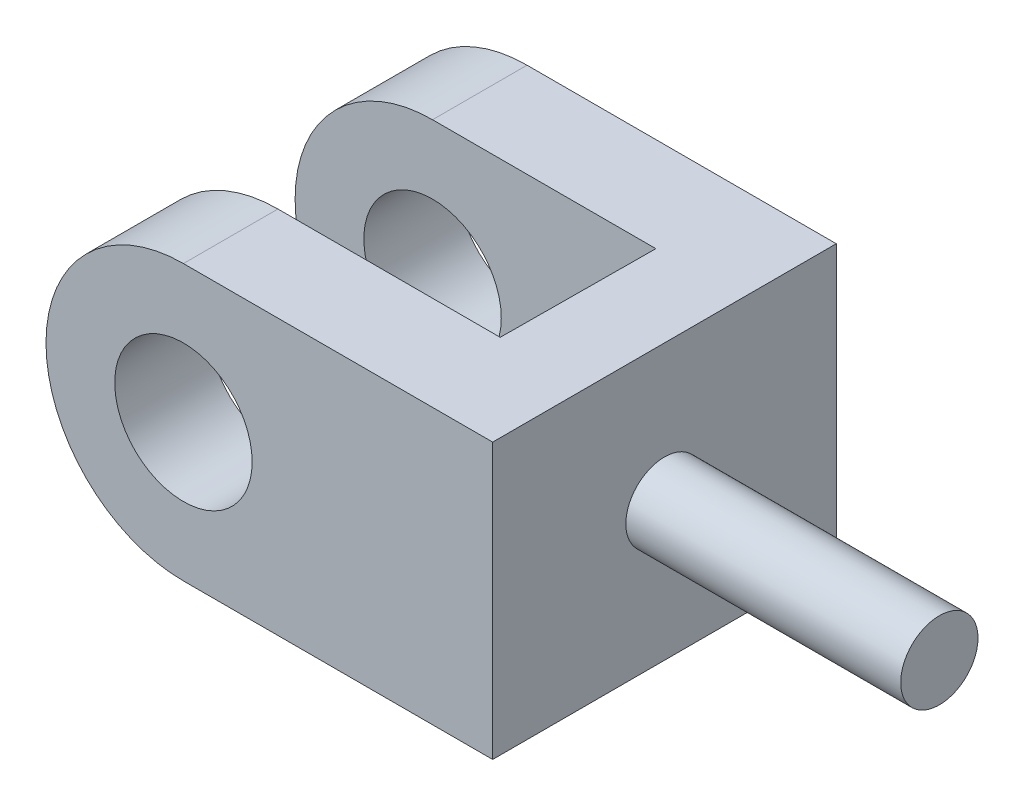
ISO-10303-21;
HEADER;
FILE_DESCRIPTION(('STEP AP214'),'2;1');
FILE_NAME('part.step','',(''),(''),'','','');
FILE_SCHEMA(('AUTOMOTIVE_DESIGN { 1 0 10303 214 1 1 1 1 }'));
ENDSEC;
DATA;
#1=APPLICATION_CONTEXT('core data for automotive mechanical design processes');
#2=APPLICATION_PROTOCOL_DEFINITION('international standard','automotive_design',2000,#1);
#3=PRODUCT_CONTEXT('',#1,'mechanical');
#4=PRODUCT('Part','Part','',(#3));
#5=PRODUCT_RELATED_PRODUCT_CATEGORY('part','',(#4));
#6=PRODUCT_DEFINITION_FORMATION('','',#4);
#7=PRODUCT_DEFINITION_CONTEXT('part definition',#1,'design');
#8=PRODUCT_DEFINITION('design','',#6,#7);
#9=PRODUCT_DEFINITION_SHAPE('','',#8);
#10=(LENGTH_UNIT() NAMED_UNIT(*) SI_UNIT(.MILLI.,.METRE.));
#11=(NAMED_UNIT(*) PLANE_ANGLE_UNIT() SI_UNIT($,.RADIAN.));
#12=(NAMED_UNIT(*) SI_UNIT($,.STERADIAN.) SOLID_ANGLE_UNIT());
#13=UNCERTAINTY_MEASURE_WITH_UNIT(LENGTH_MEASURE(1.E-05),#10,'distance_accuracy_value','');
#14=(GEOMETRIC_REPRESENTATION_CONTEXT(3) GLOBAL_UNCERTAINTY_ASSIGNED_CONTEXT((#13)) GLOBAL_UNIT_ASSIGNED_CONTEXT((#10,
#11,#12)) REPRESENTATION_CONTEXT('',''));
#15=CARTESIAN_POINT('',(0.,0.,0.));
#16=DIRECTION('',(0.,0.,1.));
#17=DIRECTION('',(1.,0.,0.));
#18=AXIS2_PLACEMENT_3D('',#15,#16,#17);
#19=CARTESIAN_POINT('',(0.,16.,40.));
#20=DIRECTION('',(0.,0.,-1.));
#21=DIRECTION('',(-1.,0.,0.));
#22=AXIS2_PLACEMENT_3D('',#19,#20,#21);
#23=CYLINDRICAL_SURFACE('',#22,16.);
#24=CARTESIAN_POINT('',(0.,16.,11.));
#25=DIRECTION('',(0.,0.,1.));
#26=DIRECTION('',(1.,0.,0.));
#27=AXIS2_PLACEMENT_3D('',#24,#25,#26);
#28=CIRCLE('',#27,16.);
#29=CARTESIAN_POINT('',(0.,32.,11.));
#30=VERTEX_POINT('',#29);
#31=CARTESIAN_POINT('',(0.,0.,11.));
#32=VERTEX_POINT('',#31);
#33=EDGE_CURVE('E154',#30,#32,#28,.T.);
#34=ORIENTED_EDGE('',*,*,#33,.F.);
#35=DIRECTION('',(0.,0.,-1.));
#36=VECTOR('',#35,1.);
#37=CARTESIAN_POINT('',(0.,32.,40.));
#38=LINE('',#37,#36);
#39=CARTESIAN_POINT('',(0.,32.,0.));
#40=VERTEX_POINT('',#39);
#41=EDGE_CURVE('E88',#30,#40,#38,.T.);
#42=ORIENTED_EDGE('',*,*,#41,.T.);
#43=CARTESIAN_POINT('',(0.,16.,0.));
#44=DIRECTION('',(0.,0.,1.));
#45=DIRECTION('',(1.,0.,0.));
#46=AXIS2_PLACEMENT_3D('',#43,#44,#45);
#47=CIRCLE('',#46,16.);
#48=CARTESIAN_POINT('',(0.,0.,0.));
#49=VERTEX_POINT('',#48);
#50=EDGE_CURVE('E169',#40,#49,#47,.T.);
#51=ORIENTED_EDGE('',*,*,#50,.T.);
#52=DIRECTION('',(0.,0.,-1.));
#53=VECTOR('',#52,1.);
#54=CARTESIAN_POINT('',(0.,0.,40.));
#55=LINE('',#54,#53);
#56=EDGE_CURVE('E205',#32,#49,#55,.T.);
#57=ORIENTED_EDGE('',*,*,#56,.F.);
#58=EDGE_LOOP('',(#34,#42,#51,#57));
#59=FACE_BOUND('',#58,.T.);
#60=ADVANCED_FACE('F39',(#59),#23,.T.);
#61=CARTESIAN_POINT('',(0.,16.,40.));
#62=DIRECTION('',(0.,0.,-1.));
#63=DIRECTION('',(-1.,0.,0.));
#64=AXIS2_PLACEMENT_3D('',#61,#62,#63);
#65=CYLINDRICAL_SURFACE('',#64,8.);
#66=CARTESIAN_POINT('',(0.,16.,0.));
#67=DIRECTION('',(0.,0.,1.));
#68=DIRECTION('',(1.,0.,0.));
#69=AXIS2_PLACEMENT_3D('',#66,#67,#68);
#70=CIRCLE('',#69,8.);
#71=CARTESIAN_POINT('',(8.,16.,0.));
#72=VERTEX_POINT('',#71);
#73=EDGE_CURVE('E164',#72,#72,#70,.T.);
#74=ORIENTED_EDGE('',*,*,#73,.F.);
#75=EDGE_LOOP('',(#74));
#76=FACE_BOUND('',#75,.T.);
#77=CARTESIAN_POINT('',(0.,16.,11.));
#78=DIRECTION('',(0.,0.,1.));
#79=DIRECTION('',(1.,0.,0.));
#80=AXIS2_PLACEMENT_3D('',#77,#78,#79);
#81=CIRCLE('',#80,8.);
#82=CARTESIAN_POINT('',(8.,16.,11.));
#83=VERTEX_POINT('',#82);
#84=EDGE_CURVE('E125',#83,#83,#81,.T.);
#85=ORIENTED_EDGE('',*,*,#84,.T.);
#86=EDGE_LOOP('',(#85));
#87=FACE_BOUND('',#86,.T.);
#88=ADVANCED_FACE('F211',(#76,#87),#65,.F.);
#89=CARTESIAN_POINT('',(0.,16.,40.));
#90=DIRECTION('',(0.,0.,1.));
#91=DIRECTION('',(1.,0.,0.));
#92=AXIS2_PLACEMENT_3D('',#89,#90,#91);
#93=PLANE('',#92);
#94=CARTESIAN_POINT('',(0.,16.,40.));
#95=DIRECTION('',(0.,0.,1.));
#96=DIRECTION('',(1.,0.,0.));
#97=AXIS2_PLACEMENT_3D('',#94,#95,#96);
#98=CIRCLE('',#97,16.);
#99=CARTESIAN_POINT('',(0.,32.,40.));
#100=VERTEX_POINT('',#99);
#101=CARTESIAN_POINT('',(0.,0.,40.));
#102=VERTEX_POINT('',#101);
#103=EDGE_CURVE('E173',#100,#102,#98,.T.);
#104=ORIENTED_EDGE('',*,*,#103,.T.);
#105=DIRECTION('',(1.,0.,0.));
#106=VECTOR('',#105,1.);
#107=CARTESIAN_POINT('',(0.,0.,40.));
#108=LINE('',#107,#106);
#109=CARTESIAN_POINT('',(36.,0.,40.));
#110=VERTEX_POINT('',#109);
#111=EDGE_CURVE('E96',#102,#110,#108,.T.);
#112=ORIENTED_EDGE('',*,*,#111,.T.);
#113=DIRECTION('',(0.,1.,0.));
#114=VECTOR('',#113,1.);
#115=CARTESIAN_POINT('',(36.,0.,40.));
#116=LINE('',#115,#114);
#117=CARTESIAN_POINT('',(36.,32.,40.));
#118=VERTEX_POINT('',#117);
#119=EDGE_CURVE('E179',#110,#118,#116,.T.);
#120=ORIENTED_EDGE('',*,*,#119,.T.);
#121=DIRECTION('',(-1.,0.,0.));
#122=VECTOR('',#121,1.);
#123=CARTESIAN_POINT('',(0.,32.,40.));
#124=LINE('',#123,#122);
#125=EDGE_CURVE('E66',#118,#100,#124,.T.);
#126=ORIENTED_EDGE('',*,*,#125,.T.);
#127=EDGE_LOOP('',(#104,#112,#120,#126));
#128=FACE_BOUND('',#127,.T.);
#129=CARTESIAN_POINT('',(0.,16.,40.));
#130=DIRECTION('',(0.,0.,1.));
#131=DIRECTION('',(1.,0.,0.));
#132=AXIS2_PLACEMENT_3D('',#129,#130,#131);
#133=CIRCLE('',#132,8.);
#134=CARTESIAN_POINT('',(8.,16.,40.));
#135=VERTEX_POINT('',#134);
#136=EDGE_CURVE('E165',#135,#135,#133,.T.);
#137=ORIENTED_EDGE('',*,*,#136,.F.);
#138=EDGE_LOOP('',(#137));
#139=FACE_BOUND('',#138,.T.);
#140=ADVANCED_FACE('F236',(#128,#139),#93,.T.);
#141=CARTESIAN_POINT('',(0.,16.,0.));
#142=DIRECTION('',(0.,0.,1.));
#143=DIRECTION('',(1.,0.,0.));
#144=AXIS2_PLACEMENT_3D('',#141,#142,#143);
#145=PLANE('',#144);
#146=ORIENTED_EDGE('',*,*,#50,.F.);
#147=DIRECTION('',(-1.,0.,0.));
#148=VECTOR('',#147,1.);
#149=CARTESIAN_POINT('',(0.,32.,0.));
#150=LINE('',#149,#148);
#151=CARTESIAN_POINT('',(36.,32.,0.));
#152=VERTEX_POINT('',#151);
#153=EDGE_CURVE('E176',#152,#40,#150,.T.);
#154=ORIENTED_EDGE('',*,*,#153,.F.);
#155=DIRECTION('',(0.,1.,0.));
#156=VECTOR('',#155,1.);
#157=CARTESIAN_POINT('',(36.,0.,0.));
#158=LINE('',#157,#156);
#159=CARTESIAN_POINT('',(36.,0.,0.));
#160=VERTEX_POINT('',#159);
#161=EDGE_CURVE('E189',#160,#152,#158,.T.);
#162=ORIENTED_EDGE('',*,*,#161,.F.);
#163=DIRECTION('',(1.,0.,0.));
#164=VECTOR('',#163,1.);
#165=CARTESIAN_POINT('',(0.,0.,0.));
#166=LINE('',#165,#164);
#167=EDGE_CURVE('E186',#49,#160,#166,.T.);
#168=ORIENTED_EDGE('',*,*,#167,.F.);
#169=EDGE_LOOP('',(#146,#154,#162,#168));
#170=FACE_BOUND('',#169,.T.);
#171=ORIENTED_EDGE('',*,*,#73,.T.);
#172=EDGE_LOOP('',(#171));
#173=FACE_BOUND('',#172,.T.);
#174=ADVANCED_FACE('F238',(#170,#173),#145,.F.);
#175=CARTESIAN_POINT('',(0.,32.,29.));
#176=VERTEX_POINT('',#175);
#177=EDGE_CURVE('E194',#100,#176,#38,.T.);
#178=ORIENTED_EDGE('',*,*,#177,.T.);
#179=CARTESIAN_POINT('',(0.,16.,29.));
#180=DIRECTION('',(0.,0.,1.));
#181=DIRECTION('',(1.,0.,0.));
#182=AXIS2_PLACEMENT_3D('',#179,#180,#181);
#183=CIRCLE('',#182,16.);
#184=CARTESIAN_POINT('',(0.,0.,29.));
#185=VERTEX_POINT('',#184);
#186=EDGE_CURVE('E132',#176,#185,#183,.T.);
#187=ORIENTED_EDGE('',*,*,#186,.T.);
#188=EDGE_CURVE('E49',#102,#185,#55,.T.);
#189=ORIENTED_EDGE('',*,*,#188,.F.);
#190=ORIENTED_EDGE('',*,*,#103,.F.);
#191=EDGE_LOOP('',(#178,#187,#189,#190));
#192=FACE_BOUND('',#191,.T.);
#193=ADVANCED_FACE('F41',(#192),#23,.T.);
#194=CARTESIAN_POINT('',(0.,0.,40.));
#195=DIRECTION('',(0.,1.,0.));
#196=DIRECTION('',(0.,0.,1.));
#197=AXIS2_PLACEMENT_3D('',#194,#195,#196);
#198=PLANE('',#197);
#199=ORIENTED_EDGE('',*,*,#188,.T.);
#200=DIRECTION('',(1.,0.,0.));
#201=VECTOR('',#200,1.);
#202=CARTESIAN_POINT('',(0.,0.,29.));
#203=LINE('',#202,#201);
#204=CARTESIAN_POINT('',(25.8761983675504,0.,29.));
#205=VERTEX_POINT('',#204);
#206=EDGE_CURVE('E157',#185,#205,#203,.T.);
#207=ORIENTED_EDGE('',*,*,#206,.T.);
#208=DIRECTION('',(-0.00687770579615513,0.,0.999976348301789));
#209=VECTOR('',#208,1.);
#210=CARTESIAN_POINT('',(25.7993213755623,0.,40.1774443390215));
#211=LINE('',#210,#209);
#212=CARTESIAN_POINT('',(26.,0.,11.));
#213=VERTEX_POINT('',#212);
#214=EDGE_CURVE('E121',#213,#205,#211,.T.);
#215=ORIENTED_EDGE('',*,*,#214,.F.);
#216=DIRECTION('',(1.,0.,0.));
#217=VECTOR('',#216,1.);
#218=CARTESIAN_POINT('',(0.,0.,11.));
#219=LINE('',#218,#217);
#220=EDGE_CURVE('E151',#32,#213,#219,.T.);
#221=ORIENTED_EDGE('',*,*,#220,.F.);
#222=ORIENTED_EDGE('',*,*,#56,.T.);
#223=ORIENTED_EDGE('',*,*,#167,.T.);
#224=DIRECTION('',(0.,0.,-1.));
#225=VECTOR('',#224,1.);
#226=CARTESIAN_POINT('',(36.,0.,40.));
#227=LINE('',#226,#225);
#228=EDGE_CURVE('E201',#110,#160,#227,.T.);
#229=ORIENTED_EDGE('',*,*,#228,.F.);
#230=ORIENTED_EDGE('',*,*,#111,.F.);
#231=EDGE_LOOP('',(#199,#207,#215,#221,#222,#223,#229,#230));
#232=FACE_BOUND('',#231,.T.);
#233=ADVANCED_FACE('F220',(#232),#198,.F.);
#234=CARTESIAN_POINT('',(36.,0.,40.));
#235=DIRECTION('',(-1.,0.,0.));
#236=DIRECTION('',(0.,0.,1.));
#237=AXIS2_PLACEMENT_3D('',#234,#235,#236);
#238=PLANE('',#237);
#239=CARTESIAN_POINT('',(36.,16.,20.));
#240=DIRECTION('',(1.,0.,0.));
#241=DIRECTION('',(0.,0.,-1.));
#242=AXIS2_PLACEMENT_3D('',#239,#240,#241);
#243=CIRCLE('',#242,4.5);
#244=CARTESIAN_POINT('',(36.,16.,15.5));
#245=VERTEX_POINT('',#244);
#246=EDGE_CURVE('E11',#245,#245,#243,.T.);
#247=ORIENTED_EDGE('',*,*,#246,.F.);
#248=EDGE_LOOP('',(#247));
#249=FACE_BOUND('',#248,.T.);
#250=ORIENTED_EDGE('',*,*,#161,.T.);
#251=DIRECTION('',(0.,0.,-1.));
#252=VECTOR('',#251,1.);
#253=CARTESIAN_POINT('',(36.,32.,40.));
#254=LINE('',#253,#252);
#255=EDGE_CURVE('E197',#118,#152,#254,.T.);
#256=ORIENTED_EDGE('',*,*,#255,.F.);
#257=ORIENTED_EDGE('',*,*,#119,.F.);
#258=ORIENTED_EDGE('',*,*,#228,.T.);
#259=EDGE_LOOP('',(#250,#256,#257,#258));
#260=FACE_BOUND('',#259,.T.);
#261=ADVANCED_FACE('F255',(#249,#260),#238,.F.);
#262=CARTESIAN_POINT('',(0.,32.,40.));
#263=DIRECTION('',(0.,-1.,0.));
#264=DIRECTION('',(0.,0.,-1.));
#265=AXIS2_PLACEMENT_3D('',#262,#263,#264);
#266=PLANE('',#265);
#267=DIRECTION('',(-0.00687770579615513,0.,0.999976348301789));
#268=VECTOR('',#267,1.);
#269=CARTESIAN_POINT('',(26.0744231006316,32.,0.179336452502268));
#270=LINE('',#269,#268);
#271=CARTESIAN_POINT('',(26.,32.,11.));
#272=VERTEX_POINT('',#271);
#273=CARTESIAN_POINT('',(25.8761983675504,32.,29.));
#274=VERTEX_POINT('',#273);
#275=EDGE_CURVE('E57',#272,#274,#270,.T.);
#276=ORIENTED_EDGE('',*,*,#275,.T.);
#277=DIRECTION('',(1.,0.,0.));
#278=VECTOR('',#277,1.);
#279=CARTESIAN_POINT('',(0.,32.,29.));
#280=LINE('',#279,#278);
#281=EDGE_CURVE('E129',#176,#274,#280,.T.);
#282=ORIENTED_EDGE('',*,*,#281,.F.);
#283=ORIENTED_EDGE('',*,*,#177,.F.);
#284=ORIENTED_EDGE('',*,*,#125,.F.);
#285=ORIENTED_EDGE('',*,*,#255,.T.);
#286=ORIENTED_EDGE('',*,*,#153,.T.);
#287=ORIENTED_EDGE('',*,*,#41,.F.);
#288=DIRECTION('',(1.,0.,0.));
#289=VECTOR('',#288,1.);
#290=CARTESIAN_POINT('',(0.,32.,11.));
#291=LINE('',#290,#289);
#292=EDGE_CURVE('E136',#30,#272,#291,.T.);
#293=ORIENTED_EDGE('',*,*,#292,.T.);
#294=EDGE_LOOP('',(#276,#282,#283,#284,#285,#286,#287,#293));
#295=FACE_BOUND('',#294,.T.);
#296=ADVANCED_FACE('F139',(#295),#266,.F.);
#297=CARTESIAN_POINT('',(0.,16.,29.));
#298=DIRECTION('',(0.,0.,1.));
#299=DIRECTION('',(1.,0.,0.));
#300=AXIS2_PLACEMENT_3D('',#297,#298,#299);
#301=CIRCLE('',#300,8.);
#302=CARTESIAN_POINT('',(8.,16.,29.));
#303=VERTEX_POINT('',#302);
#304=EDGE_CURVE('E43',#303,#303,#301,.T.);
#305=ORIENTED_EDGE('',*,*,#304,.F.);
#306=EDGE_LOOP('',(#305));
#307=FACE_BOUND('',#306,.T.);
#308=ORIENTED_EDGE('',*,*,#136,.T.);
#309=EDGE_LOOP('',(#308));
#310=FACE_BOUND('',#309,.T.);
#311=ADVANCED_FACE('F230',(#307,#310),#65,.F.);
#312=CARTESIAN_POINT('',(26.0744231006316,-8.,0.179336452502268));
#313=DIRECTION('',(-0.999976348301789,0.,-0.00687770579615513));
#314=DIRECTION('',(-0.00687770579615513,0.,0.999976348301789));
#315=AXIS2_PLACEMENT_3D('',#312,#313,#314);
#316=PLANE('',#315);
#317=ORIENTED_EDGE('',*,*,#214,.T.);
#318=DIRECTION('',(0.,1.,0.));
#319=VECTOR('',#318,1.);
#320=CARTESIAN_POINT('',(25.8761983675504,-8.,29.));
#321=LINE('',#320,#319);
#322=EDGE_CURVE('E117',#205,#274,#321,.T.);
#323=ORIENTED_EDGE('',*,*,#322,.T.);
#324=ORIENTED_EDGE('',*,*,#275,.F.);
#325=DIRECTION('',(0.,1.,0.));
#326=VECTOR('',#325,1.);
#327=CARTESIAN_POINT('',(26.,-8.,11.));
#328=LINE('',#327,#326);
#329=EDGE_CURVE('E126',#213,#272,#328,.T.);
#330=ORIENTED_EDGE('',*,*,#329,.F.);
#331=EDGE_LOOP('',(#317,#323,#324,#330));
#332=FACE_BOUND('',#331,.T.);
#333=ADVANCED_FACE('F119',(#332),#316,.T.);
#334=CARTESIAN_POINT('',(0.,-8.,29.));
#335=DIRECTION('',(0.,0.,1.));
#336=DIRECTION('',(1.,0.,0.));
#337=AXIS2_PLACEMENT_3D('',#334,#335,#336);
#338=PLANE('',#337);
#339=ORIENTED_EDGE('',*,*,#304,.T.);
#340=EDGE_LOOP('',(#339));
#341=FACE_BOUND('',#340,.T.);
#342=ORIENTED_EDGE('',*,*,#281,.T.);
#343=ORIENTED_EDGE('',*,*,#322,.F.);
#344=ORIENTED_EDGE('',*,*,#206,.F.);
#345=ORIENTED_EDGE('',*,*,#186,.F.);
#346=EDGE_LOOP('',(#342,#343,#344,#345));
#347=FACE_BOUND('',#346,.T.);
#348=ADVANCED_FACE('F130',(#341,#347),#338,.F.);
#349=CARTESIAN_POINT('',(0.,-8.,11.));
#350=DIRECTION('',(0.,0.,1.));
#351=DIRECTION('',(1.,0.,0.));
#352=AXIS2_PLACEMENT_3D('',#349,#350,#351);
#353=PLANE('',#352);
#354=ORIENTED_EDGE('',*,*,#84,.F.);
#355=EDGE_LOOP('',(#354));
#356=FACE_BOUND('',#355,.T.);
#357=ORIENTED_EDGE('',*,*,#33,.T.);
#358=ORIENTED_EDGE('',*,*,#220,.T.);
#359=ORIENTED_EDGE('',*,*,#329,.T.);
#360=ORIENTED_EDGE('',*,*,#292,.F.);
#361=EDGE_LOOP('',(#357,#358,#359,#360));
#362=FACE_BOUND('',#361,.T.);
#363=ADVANCED_FACE('F213',(#356,#362),#353,.T.);
#364=CARTESIAN_POINT('',(68.,16.,20.));
#365=DIRECTION('',(-1.,0.,0.));
#366=DIRECTION('',(0.,0.,1.));
#367=AXIS2_PLACEMENT_3D('',#364,#365,#366);
#368=CYLINDRICAL_SURFACE('',#367,4.5);
#369=CARTESIAN_POINT('',(68.,16.,20.));
#370=DIRECTION('',(1.,0.,0.));
#371=DIRECTION('',(0.,0.,-1.));
#372=AXIS2_PLACEMENT_3D('',#369,#370,#371);
#373=CIRCLE('',#372,4.5);
#374=CARTESIAN_POINT('',(68.,16.,15.5));
#375=VERTEX_POINT('',#374);
#376=EDGE_CURVE('E141',#375,#375,#373,.T.);
#377=ORIENTED_EDGE('',*,*,#376,.F.);
#378=EDGE_LOOP('',(#377));
#379=FACE_BOUND('',#378,.T.);
#380=ORIENTED_EDGE('',*,*,#246,.T.);
#381=EDGE_LOOP('',(#380));
#382=FACE_BOUND('',#381,.T.);
#383=ADVANCED_FACE('F216',(#379,#382),#368,.T.);
#384=CARTESIAN_POINT('',(68.,16.,20.));
#385=DIRECTION('',(1.,0.,0.));
#386=DIRECTION('',(0.,0.,-1.));
#387=AXIS2_PLACEMENT_3D('',#384,#385,#386);
#388=PLANE('',#387);
#389=ORIENTED_EDGE('',*,*,#376,.T.);
#390=EDGE_LOOP('',(#389));
#391=FACE_BOUND('',#390,.T.);
#392=ADVANCED_FACE('F274',(#391),#388,.T.);
#393=CLOSED_SHELL('',(#60,#88,#140,#174,#193,#233,#261,#296,#311,#333,#348,#363,#383,#392));
#394=MANIFOLD_SOLID_BREP('B2',#393);
#395=ADVANCED_BREP_SHAPE_REPRESENTATION('',(#18,#394),#14);
#396=SHAPE_DEFINITION_REPRESENTATION(#9,#395);
ENDSEC;
END-ISO-10303-21;
